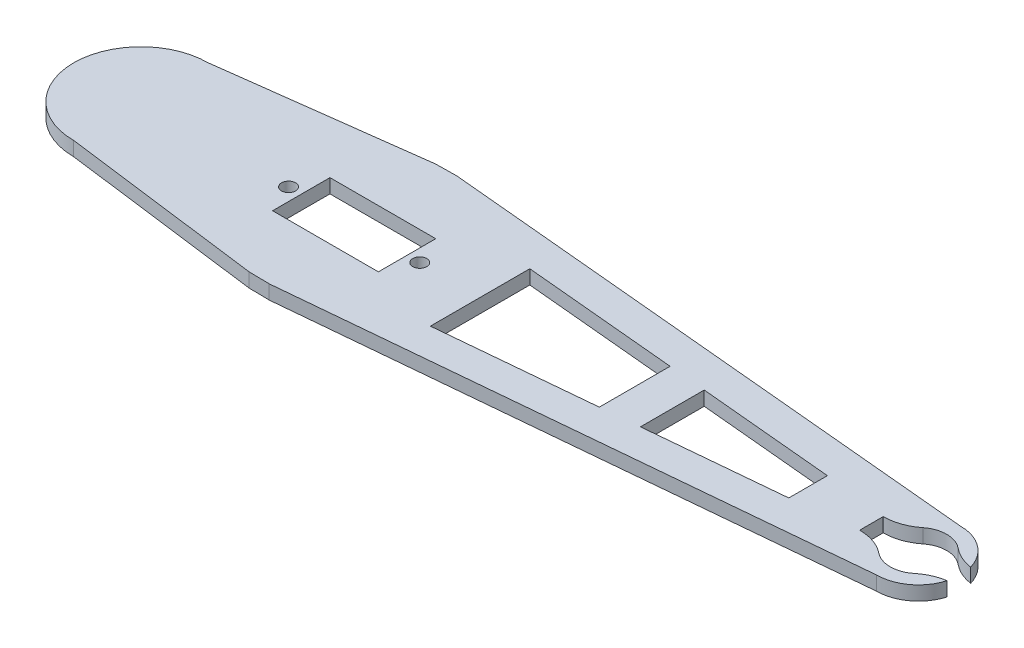
ISO-10303-21;
HEADER;
FILE_DESCRIPTION(('STEP AP214'),'2;1');
FILE_NAME('part.step','',(''),(''),'','','');
FILE_SCHEMA(('AUTOMOTIVE_DESIGN { 1 0 10303 214 1 1 1 1 }'));
ENDSEC;
DATA;
#1=APPLICATION_CONTEXT('core data for automotive mechanical design processes');
#2=APPLICATION_PROTOCOL_DEFINITION('international standard','automotive_design',2000,#1);
#3=PRODUCT_CONTEXT('',#1,'mechanical');
#4=PRODUCT('Part','Part','',(#3));
#5=PRODUCT_RELATED_PRODUCT_CATEGORY('part','',(#4));
#6=PRODUCT_DEFINITION_FORMATION('','',#4);
#7=PRODUCT_DEFINITION_CONTEXT('part definition',#1,'design');
#8=PRODUCT_DEFINITION('design','',#6,#7);
#9=PRODUCT_DEFINITION_SHAPE('','',#8);
#10=(LENGTH_UNIT() NAMED_UNIT(*) SI_UNIT(.MILLI.,.METRE.));
#11=(NAMED_UNIT(*) PLANE_ANGLE_UNIT() SI_UNIT($,.RADIAN.));
#12=(NAMED_UNIT(*) SI_UNIT($,.STERADIAN.) SOLID_ANGLE_UNIT());
#13=UNCERTAINTY_MEASURE_WITH_UNIT(LENGTH_MEASURE(1.E-05),#10,'distance_accuracy_value','');
#14=(GEOMETRIC_REPRESENTATION_CONTEXT(3) GLOBAL_UNCERTAINTY_ASSIGNED_CONTEXT((#13)) GLOBAL_UNIT_ASSIGNED_CONTEXT((#10,
#11,#12)) REPRESENTATION_CONTEXT('',''));
#15=CARTESIAN_POINT('',(0.,0.,0.));
#16=DIRECTION('',(0.,0.,1.));
#17=DIRECTION('',(1.,0.,0.));
#18=AXIS2_PLACEMENT_3D('',#15,#16,#17);
#19=CARTESIAN_POINT('',(120.,3.,0.));
#20=DIRECTION('',(0.,-1.,0.));
#21=DIRECTION('',(0.,0.,-1.));
#22=AXIS2_PLACEMENT_3D('',#19,#20,#21);
#23=CYLINDRICAL_SURFACE('',#22,8.95776317127611);
#24=CARTESIAN_POINT('',(120.,3.,0.));
#25=DIRECTION('',(0.,1.,0.));
#26=DIRECTION('',(0.,0.,-1.));
#27=AXIS2_PLACEMENT_3D('',#24,#25,#26);
#28=CIRCLE('',#27,8.95776317127611);
#29=CARTESIAN_POINT('',(128.601832422959,3.,-2.5));
#30=VERTEX_POINT('',#29);
#31=CARTESIAN_POINT('',(120.,3.,-8.95776317127611));
#32=VERTEX_POINT('',#31);
#33=EDGE_CURVE('E403',#30,#32,#28,.T.);
#34=ORIENTED_EDGE('',*,*,#33,.F.);
#35=DIRECTION('',(0.,-1.,0.));
#36=VECTOR('',#35,1.);
#37=CARTESIAN_POINT('',(128.601832422959,3.,-2.5));
#38=LINE('',#37,#36);
#39=CARTESIAN_POINT('',(128.601832422959,0.,-2.5));
#40=VERTEX_POINT('',#39);
#41=EDGE_CURVE('E272',#30,#40,#38,.T.);
#42=ORIENTED_EDGE('',*,*,#41,.T.);
#43=CARTESIAN_POINT('',(120.,0.,0.));
#44=DIRECTION('',(0.,1.,0.));
#45=DIRECTION('',(0.,0.,-1.));
#46=AXIS2_PLACEMENT_3D('',#43,#44,#45);
#47=CIRCLE('',#46,8.95776317127611);
#48=CARTESIAN_POINT('',(120.,0.,-8.95776317127611));
#49=VERTEX_POINT('',#48);
#50=EDGE_CURVE('E422',#40,#49,#47,.T.);
#51=ORIENTED_EDGE('',*,*,#50,.T.);
#52=DIRECTION('',(0.,-1.,0.));
#53=VECTOR('',#52,1.);
#54=CARTESIAN_POINT('',(120.,3.,-8.95776317127611));
#55=LINE('',#54,#53);
#56=EDGE_CURVE('E429',#32,#49,#55,.T.);
#57=ORIENTED_EDGE('',*,*,#56,.F.);
#58=EDGE_LOOP('',(#34,#42,#51,#57));
#59=FACE_BOUND('',#58,.T.);
#60=ADVANCED_FACE('F37',(#59),#23,.T.);
#61=CARTESIAN_POINT('',(120.,3.,0.));
#62=DIRECTION('',(0.,-1.,0.));
#63=DIRECTION('',(0.,0.,-1.));
#64=AXIS2_PLACEMENT_3D('',#61,#62,#63);
#65=CYLINDRICAL_SURFACE('',#64,6.00000000000002);
#66=CARTESIAN_POINT('',(120.,0.,0.));
#67=DIRECTION('',(0.,1.,0.));
#68=DIRECTION('',(0.,0.,1.));
#69=AXIS2_PLACEMENT_3D('',#66,#67,#68);
#70=CIRCLE('',#69,6.00000000000002);
#71=CARTESIAN_POINT('',(123.800020625864,0.,-4.64325782646303));
#72=VERTEX_POINT('',#71);
#73=CARTESIAN_POINT('',(116.254690433355,0.,-4.68750000000001));
#74=VERTEX_POINT('',#73);
#75=EDGE_CURVE('E280',#72,#74,#70,.T.);
#76=ORIENTED_EDGE('',*,*,#75,.F.);
#77=DIRECTION('',(0.,-1.,0.));
#78=VECTOR('',#77,1.);
#79=CARTESIAN_POINT('',(123.800020625864,3.,-4.64325782646303));
#80=LINE('',#79,#78);
#81=CARTESIAN_POINT('',(123.800020625864,3.,-4.64325782646302));
#82=VERTEX_POINT('',#81);
#83=EDGE_CURVE('E460',#72,#82,#80,.F.);
#84=ORIENTED_EDGE('',*,*,#83,.T.);
#85=CARTESIAN_POINT('',(120.,3.,0.));
#86=DIRECTION('',(0.,1.,0.));
#87=DIRECTION('',(0.,0.,1.));
#88=AXIS2_PLACEMENT_3D('',#85,#86,#87);
#89=CIRCLE('',#88,6.00000000000002);
#90=CARTESIAN_POINT('',(116.254690433355,3.,-4.68750000000001));
#91=VERTEX_POINT('',#90);
#92=EDGE_CURVE('E279',#82,#91,#89,.T.);
#93=ORIENTED_EDGE('',*,*,#92,.T.);
#94=DIRECTION('',(0.,-1.,0.));
#95=VECTOR('',#94,1.);
#96=CARTESIAN_POINT('',(116.254690433355,3.,-4.68750000000001));
#97=LINE('',#96,#95);
#98=EDGE_CURVE('E458',#91,#74,#97,.T.);
#99=ORIENTED_EDGE('',*,*,#98,.T.);
#100=EDGE_LOOP('',(#76,#84,#93,#99));
#101=FACE_BOUND('',#100,.T.);
#102=ADVANCED_FACE('F532',(#101),#65,.F.);
#103=CARTESIAN_POINT('',(120.,3.,0.));
#104=DIRECTION('',(0.,-1.,0.));
#105=DIRECTION('',(0.,0.,-1.));
#106=AXIS2_PLACEMENT_3D('',#103,#104,#105);
#107=PLANE('',#106);
#108=CARTESIAN_POINT('',(-13.95,3.,0.));
#109=DIRECTION('',(0.,1.,0.));
#110=DIRECTION('',(0.,0.,1.));
#111=AXIS2_PLACEMENT_3D('',#108,#109,#110);
#112=CIRCLE('',#111,1.5);
#113=CARTESIAN_POINT('',(-13.95,3.,1.5));
#114=VERTEX_POINT('',#113);
#115=EDGE_CURVE('E315',#114,#114,#112,.T.);
#116=ORIENTED_EDGE('',*,*,#115,.F.);
#117=EDGE_LOOP('',(#116));
#118=FACE_BOUND('',#117,.T.);
#119=CARTESIAN_POINT('',(13.95,3.,0.));
#120=DIRECTION('',(0.,1.,0.));
#121=DIRECTION('',(0.,0.,1.));
#122=AXIS2_PLACEMENT_3D('',#119,#120,#121);
#123=CIRCLE('',#122,1.5);
#124=CARTESIAN_POINT('',(13.95,3.,1.5));
#125=VERTEX_POINT('',#124);
#126=EDGE_CURVE('E321',#125,#125,#123,.T.);
#127=ORIENTED_EDGE('',*,*,#126,.F.);
#128=EDGE_LOOP('',(#127));
#129=FACE_BOUND('',#128,.T.);
#130=DIRECTION('',(0.,0.,-1.));
#131=VECTOR('',#130,1.);
#132=CARTESIAN_POINT('',(96.5291672845656,3.,-4.10426717337135));
#133=LINE('',#132,#131);
#134=CARTESIAN_POINT('',(96.5291672845656,3.,4.10426717337135));
#135=VERTEX_POINT('',#134);
#136=CARTESIAN_POINT('',(96.5291672845656,3.,-4.10426717337135));
#137=VERTEX_POINT('',#136);
#138=EDGE_CURVE('E327',#135,#137,#133,.T.);
#139=ORIENTED_EDGE('',*,*,#138,.F.);
#140=DIRECTION('',(0.9957277620175,0.,-0.0923375543731872));
#141=VECTOR('',#140,1.);
#142=CARTESIAN_POINT('',(96.5291672845656,3.,4.10426717337135));
#143=LINE('',#142,#141);
#144=CARTESIAN_POINT('',(67.6603473994946,3.,6.78138066514184));
#145=VERTEX_POINT('',#144);
#146=EDGE_CURVE('E335',#145,#135,#143,.T.);
#147=ORIENTED_EDGE('',*,*,#146,.F.);
#148=DIRECTION('',(0.,0.,1.));
#149=VECTOR('',#148,1.);
#150=CARTESIAN_POINT('',(67.6603473994946,3.,-6.78138066514184));
#151=LINE('',#150,#149);
#152=CARTESIAN_POINT('',(67.6603473994946,3.,-6.78138066514184));
#153=VERTEX_POINT('',#152);
#154=EDGE_CURVE('E332',#153,#145,#151,.T.);
#155=ORIENTED_EDGE('',*,*,#154,.F.);
#156=DIRECTION('',(-0.9957277620175,0.,-0.092337554373187));
#157=VECTOR('',#156,1.);
#158=CARTESIAN_POINT('',(96.5291672845656,3.,-4.10426717337135));
#159=LINE('',#158,#157);
#160=EDGE_CURVE('E329',#137,#153,#159,.T.);
#161=ORIENTED_EDGE('',*,*,#160,.F.);
#162=EDGE_LOOP('',(#139,#147,#155,#161));
#163=FACE_BOUND('',#162,.T.);
#164=ORIENTED_EDGE('',*,*,#92,.F.);
#165=CARTESIAN_POINT('',(130.133388335637,3.,-12.382020870568));
#166=DIRECTION('',(0.,-1.,0.));
#167=DIRECTION('',(0.,0.,-1.));
#168=AXIS2_PLACEMENT_3D('',#165,#166,#167);
#169=CIRCLE('',#168,10.);
#170=EDGE_CURVE('E466',#82,#30,#169,.F.);
#171=ORIENTED_EDGE('',*,*,#170,.T.);
#172=ORIENTED_EDGE('',*,*,#33,.T.);
#173=DIRECTION('',(-0.9957277620175,0.,-0.0923375543731871));
#174=VECTOR('',#173,1.);
#175=CARTESIAN_POINT('',(1.84675108746374,3.,-19.91455524035));
#176=LINE('',#175,#174);
#177=CARTESIAN_POINT('',(1.84675108746374,3.,-19.91455524035));
#178=VERTEX_POINT('',#177);
#179=EDGE_CURVE('E407',#32,#178,#176,.T.);
#180=ORIENTED_EDGE('',*,*,#179,.T.);
#181=DIRECTION('',(-0.999836383133335,0.,0.018088862950765));
#182=VECTOR('',#181,1.);
#183=CARTESIAN_POINT('',(-2.56588798882,3.,-19.834722554874));
#184=LINE('',#183,#182);
#185=CARTESIAN_POINT('',(-2.56588798882,3.,-19.834722554874));
#186=VERTEX_POINT('',#185);
#187=EDGE_CURVE('E389',#178,#186,#184,.T.);
#188=ORIENTED_EDGE('',*,*,#187,.T.);
#189=DIRECTION('',(-0.991736127743702,0.,0.128294399441));
#190=VECTOR('',#189,1.);
#191=CARTESIAN_POINT('',(-45.3434905183184,3.,-14.3008646338827));
#192=LINE('',#191,#190);
#193=CARTESIAN_POINT('',(-45.3434905183184,3.,-14.3008646338827));
#194=VERTEX_POINT('',#193);
#195=EDGE_CURVE('E392',#186,#194,#192,.T.);
#196=ORIENTED_EDGE('',*,*,#195,.T.);
#197=CARTESIAN_POINT('',(-45.3434905183184,3.,0.));
#198=DIRECTION('',(0.,1.,0.));
#199=DIRECTION('',(0.,0.,1.));
#200=AXIS2_PLACEMENT_3D('',#197,#198,#199);
#201=CIRCLE('',#200,14.3008646338827);
#202=CARTESIAN_POINT('',(-45.3434905183184,3.,14.3008646338827));
#203=VERTEX_POINT('',#202);
#204=EDGE_CURVE('E395',#194,#203,#201,.T.);
#205=ORIENTED_EDGE('',*,*,#204,.T.);
#206=DIRECTION('',(0.991736127743702,0.,0.128294399441));
#207=VECTOR('',#206,1.);
#208=CARTESIAN_POINT('',(-45.3434905183184,3.,14.3008646338827));
#209=LINE('',#208,#207);
#210=CARTESIAN_POINT('',(-2.56588798882,3.,19.834722554874));
#211=VERTEX_POINT('',#210);
#212=EDGE_CURVE('E397',#203,#211,#209,.T.);
#213=ORIENTED_EDGE('',*,*,#212,.T.);
#214=DIRECTION('',(0.999836383133335,0.,0.0180888629507665));
#215=VECTOR('',#214,1.);
#216=CARTESIAN_POINT('',(-2.56588798882,3.,19.834722554874));
#217=LINE('',#216,#215);
#218=CARTESIAN_POINT('',(1.84675108746374,3.,19.91455524035));
#219=VERTEX_POINT('',#218);
#220=EDGE_CURVE('E399',#211,#219,#217,.T.);
#221=ORIENTED_EDGE('',*,*,#220,.T.);
#222=DIRECTION('',(0.9957277620175,0.,-0.0923375543731872));
#223=VECTOR('',#222,1.);
#224=CARTESIAN_POINT('',(120.,3.,8.95776317127611));
#225=LINE('',#224,#223);
#226=CARTESIAN_POINT('',(120.,3.,8.95776317127611));
#227=VERTEX_POINT('',#226);
#228=EDGE_CURVE('E401',#219,#227,#225,.T.);
#229=ORIENTED_EDGE('',*,*,#228,.T.);
#230=CARTESIAN_POINT('',(128.601832422959,3.,2.5));
#231=VERTEX_POINT('',#230);
#232=EDGE_CURVE('E404',#227,#231,#28,.T.);
#233=ORIENTED_EDGE('',*,*,#232,.T.);
#234=CARTESIAN_POINT('',(130.133388335637,3.,12.382020870568));
#235=DIRECTION('',(0.,-1.,0.));
#236=DIRECTION('',(0.,0.,-1.));
#237=AXIS2_PLACEMENT_3D('',#234,#235,#236);
#238=CIRCLE('',#237,10.);
#239=CARTESIAN_POINT('',(123.800020625864,3.,4.64325782646303));
#240=VERTEX_POINT('',#239);
#241=EDGE_CURVE('E464',#231,#240,#238,.F.);
#242=ORIENTED_EDGE('',*,*,#241,.T.);
#243=CARTESIAN_POINT('',(116.254690433355,3.,4.68750000000001));
#244=VERTEX_POINT('',#243);
#245=EDGE_CURVE('E276',#244,#240,#89,.T.);
#246=ORIENTED_EDGE('',*,*,#245,.F.);
#247=CARTESIAN_POINT('',(110.012507822281,3.,12.5));
#248=DIRECTION('',(0.,-1.,0.));
#249=DIRECTION('',(0.,0.,-1.));
#250=AXIS2_PLACEMENT_3D('',#247,#248,#249);
#251=CIRCLE('',#250,10.);
#252=CARTESIAN_POINT('',(110.012507822281,3.,2.5));
#253=VERTEX_POINT('',#252);
#254=EDGE_CURVE('E59',#244,#253,#251,.F.);
#255=ORIENTED_EDGE('',*,*,#254,.T.);
#256=DIRECTION('',(1.,0.,0.));
#257=VECTOR('',#256,1.);
#258=CARTESIAN_POINT('',(130.,3.,2.5));
#259=LINE('',#258,#257);
#260=CARTESIAN_POINT('',(110.,3.,2.5));
#261=VERTEX_POINT('',#260);
#262=EDGE_CURVE('E262',#261,#253,#259,.T.);
#263=ORIENTED_EDGE('',*,*,#262,.F.);
#264=DIRECTION('',(0.,0.,1.));
#265=VECTOR('',#264,1.);
#266=CARTESIAN_POINT('',(110.,3.,-2.5));
#267=LINE('',#266,#265);
#268=CARTESIAN_POINT('',(110.,3.,-2.5));
#269=VERTEX_POINT('',#268);
#270=EDGE_CURVE('E243',#269,#261,#267,.T.);
#271=ORIENTED_EDGE('',*,*,#270,.F.);
#272=DIRECTION('',(-1.,0.,0.));
#273=VECTOR('',#272,1.);
#274=CARTESIAN_POINT('',(130.,3.,-2.5));
#275=LINE('',#274,#273);
#276=CARTESIAN_POINT('',(110.012507822281,3.,-2.5));
#277=VERTEX_POINT('',#276);
#278=EDGE_CURVE('E260',#277,#269,#275,.T.);
#279=ORIENTED_EDGE('',*,*,#278,.F.);
#280=CARTESIAN_POINT('',(110.012507822281,3.,-12.5));
#281=DIRECTION('',(0.,-1.,0.));
#282=DIRECTION('',(0.,0.,-1.));
#283=AXIS2_PLACEMENT_3D('',#280,#281,#282);
#284=CIRCLE('',#283,10.);
#285=EDGE_CURVE('E52',#277,#91,#284,.F.);
#286=ORIENTED_EDGE('',*,*,#285,.T.);
#287=EDGE_LOOP('',(#164,#171,#172,#180,#188,#196,#205,#213,#221,#229,#233,#242,#246,#255,#263,
#271,#279,#286));
#288=FACE_BOUND('',#287,.T.);
#289=DIRECTION('',(0.,0.,-1.));
#290=VECTOR('',#289,1.);
#291=CARTESIAN_POINT('',(11.25,3.,-6.1));
#292=LINE('',#291,#290);
#293=CARTESIAN_POINT('',(11.25,3.,6.1));
#294=VERTEX_POINT('',#293);
#295=CARTESIAN_POINT('',(11.25,3.,-6.1));
#296=VERTEX_POINT('',#295);
#297=EDGE_CURVE('E358',#294,#296,#292,.T.);
#298=ORIENTED_EDGE('',*,*,#297,.F.);
#299=DIRECTION('',(1.,0.,0.));
#300=VECTOR('',#299,1.);
#301=CARTESIAN_POINT('',(-11.25,3.,6.1));
#302=LINE('',#301,#300);
#303=CARTESIAN_POINT('',(-11.25,3.,6.1));
#304=VERTEX_POINT('',#303);
#305=EDGE_CURVE('E366',#304,#294,#302,.T.);
#306=ORIENTED_EDGE('',*,*,#305,.F.);
#307=DIRECTION('',(0.,0.,1.));
#308=VECTOR('',#307,1.);
#309=CARTESIAN_POINT('',(-11.25,3.,-6.1));
#310=LINE('',#309,#308);
#311=CARTESIAN_POINT('',(-11.25,3.,-6.1));
#312=VERTEX_POINT('',#311);
#313=EDGE_CURVE('E363',#312,#304,#310,.T.);
#314=ORIENTED_EDGE('',*,*,#313,.F.);
#315=DIRECTION('',(-1.,0.,0.));
#316=VECTOR('',#315,1.);
#317=CARTESIAN_POINT('',(-11.25,3.,-6.1));
#318=LINE('',#317,#316);
#319=EDGE_CURVE('E360',#296,#312,#318,.T.);
#320=ORIENTED_EDGE('',*,*,#319,.F.);
#321=EDGE_LOOP('',(#298,#306,#314,#320));
#322=FACE_BOUND('',#321,.T.);
#323=DIRECTION('',(0.,0.,-1.));
#324=VECTOR('',#323,1.);
#325=CARTESIAN_POINT('',(59.6591330402502,3.,7.52336315687362));
#326=LINE('',#325,#324);
#327=CARTESIAN_POINT('',(59.6591330402502,3.,7.52336315687362));
#328=VERTEX_POINT('',#327);
#329=CARTESIAN_POINT('',(59.6591330402502,3.,-7.52336315687363));
#330=VERTEX_POINT('',#329);
#331=EDGE_CURVE('E283',#328,#330,#326,.T.);
#332=ORIENTED_EDGE('',*,*,#331,.F.);
#333=DIRECTION('',(0.9957277620175,0.,-0.0923375543731874));
#334=VECTOR('',#333,1.);
#335=CARTESIAN_POINT('',(26.7796007232022,3.,10.5724049923036));
#336=LINE('',#335,#334);
#337=CARTESIAN_POINT('',(26.7796007232022,3.,10.5724049923036));
#338=VERTEX_POINT('',#337);
#339=EDGE_CURVE('E291',#338,#328,#336,.T.);
#340=ORIENTED_EDGE('',*,*,#339,.F.);
#341=DIRECTION('',(0.,0.,1.));
#342=VECTOR('',#341,1.);
#343=CARTESIAN_POINT('',(26.7796007232022,3.,-10.5724049923036));
#344=LINE('',#343,#342);
#345=CARTESIAN_POINT('',(26.7796007232022,3.,-10.5724049923036));
#346=VERTEX_POINT('',#345);
#347=EDGE_CURVE('E288',#346,#338,#344,.T.);
#348=ORIENTED_EDGE('',*,*,#347,.F.);
#349=DIRECTION('',(-0.9957277620175,0.,-0.092337554373187));
#350=VECTOR('',#349,1.);
#351=CARTESIAN_POINT('',(59.6591330402502,3.,-7.52336315687363));
#352=LINE('',#351,#350);
#353=EDGE_CURVE('E285',#330,#346,#352,.T.);
#354=ORIENTED_EDGE('',*,*,#353,.F.);
#355=EDGE_LOOP('',(#332,#340,#348,#354));
#356=FACE_BOUND('',#355,.T.);
#357=ADVANCED_FACE('F485',(#118,#129,#163,#288,#322,#356),#107,.F.);
#358=CARTESIAN_POINT('',(120.,0.,0.));
#359=DIRECTION('',(0.,-1.,0.));
#360=DIRECTION('',(0.,0.,-1.));
#361=AXIS2_PLACEMENT_3D('',#358,#359,#360);
#362=PLANE('',#361);
#363=ORIENTED_EDGE('',*,*,#50,.F.);
#364=CARTESIAN_POINT('',(130.133388335637,0.,-12.382020870568));
#365=DIRECTION('',(0.,-1.,0.));
#366=DIRECTION('',(0.,0.,-1.));
#367=AXIS2_PLACEMENT_3D('',#364,#365,#366);
#368=CIRCLE('',#367,10.);
#369=EDGE_CURVE('E456',#40,#72,#368,.T.);
#370=ORIENTED_EDGE('',*,*,#369,.T.);
#371=ORIENTED_EDGE('',*,*,#75,.T.);
#372=CARTESIAN_POINT('',(110.012507822281,0.,-12.5));
#373=DIRECTION('',(0.,-1.,0.));
#374=DIRECTION('',(0.,0.,-1.));
#375=AXIS2_PLACEMENT_3D('',#372,#373,#374);
#376=CIRCLE('',#375,10.);
#377=CARTESIAN_POINT('',(110.012507822281,0.,-2.5));
#378=VERTEX_POINT('',#377);
#379=EDGE_CURVE('E450',#74,#378,#376,.T.);
#380=ORIENTED_EDGE('',*,*,#379,.T.);
#381=DIRECTION('',(-1.,0.,0.));
#382=VECTOR('',#381,1.);
#383=CARTESIAN_POINT('',(130.,0.,-2.5));
#384=LINE('',#383,#382);
#385=CARTESIAN_POINT('',(110.,0.,-2.5));
#386=VERTEX_POINT('',#385);
#387=EDGE_CURVE('E246',#378,#386,#384,.T.);
#388=ORIENTED_EDGE('',*,*,#387,.T.);
#389=DIRECTION('',(0.,0.,1.));
#390=VECTOR('',#389,1.);
#391=CARTESIAN_POINT('',(110.,0.,-2.5));
#392=LINE('',#391,#390);
#393=CARTESIAN_POINT('',(110.,0.,2.5));
#394=VERTEX_POINT('',#393);
#395=EDGE_CURVE('E241',#386,#394,#392,.T.);
#396=ORIENTED_EDGE('',*,*,#395,.T.);
#397=DIRECTION('',(1.,0.,0.));
#398=VECTOR('',#397,1.);
#399=CARTESIAN_POINT('',(130.,0.,2.5));
#400=LINE('',#399,#398);
#401=CARTESIAN_POINT('',(110.012507822281,0.,2.5));
#402=VERTEX_POINT('',#401);
#403=EDGE_CURVE('E250',#394,#402,#400,.T.);
#404=ORIENTED_EDGE('',*,*,#403,.T.);
#405=CARTESIAN_POINT('',(110.012507822281,0.,12.5));
#406=DIRECTION('',(0.,-1.,0.));
#407=DIRECTION('',(0.,0.,-1.));
#408=AXIS2_PLACEMENT_3D('',#405,#406,#407);
#409=CIRCLE('',#408,10.);
#410=CARTESIAN_POINT('',(116.254690433355,0.,4.68750000000001));
#411=VERTEX_POINT('',#410);
#412=EDGE_CURVE('E452',#402,#411,#409,.T.);
#413=ORIENTED_EDGE('',*,*,#412,.T.);
#414=CARTESIAN_POINT('',(123.800020625864,0.,4.64325782646302));
#415=VERTEX_POINT('',#414);
#416=EDGE_CURVE('E275',#411,#415,#70,.T.);
#417=ORIENTED_EDGE('',*,*,#416,.T.);
#418=CARTESIAN_POINT('',(130.133388335637,0.,12.382020870568));
#419=DIRECTION('',(0.,-1.,0.));
#420=DIRECTION('',(0.,0.,-1.));
#421=AXIS2_PLACEMENT_3D('',#418,#419,#420);
#422=CIRCLE('',#421,10.);
#423=CARTESIAN_POINT('',(128.601832422959,0.,2.5));
#424=VERTEX_POINT('',#423);
#425=EDGE_CURVE('E454',#415,#424,#422,.T.);
#426=ORIENTED_EDGE('',*,*,#425,.T.);
#427=CARTESIAN_POINT('',(120.,0.,8.95776317127611));
#428=VERTEX_POINT('',#427);
#429=EDGE_CURVE('E423',#428,#424,#47,.T.);
#430=ORIENTED_EDGE('',*,*,#429,.F.);
#431=DIRECTION('',(0.9957277620175,0.,-0.0923375543731872));
#432=VECTOR('',#431,1.);
#433=CARTESIAN_POINT('',(120.,0.,8.95776317127611));
#434=LINE('',#433,#432);
#435=CARTESIAN_POINT('',(1.84675108746374,0.,19.91455524035));
#436=VERTEX_POINT('',#435);
#437=EDGE_CURVE('E420',#436,#428,#434,.T.);
#438=ORIENTED_EDGE('',*,*,#437,.F.);
#439=DIRECTION('',(0.999836383133335,0.,0.0180888629507665));
#440=VECTOR('',#439,1.);
#441=CARTESIAN_POINT('',(-2.56588798882,0.,19.834722554874));
#442=LINE('',#441,#440);
#443=CARTESIAN_POINT('',(-2.56588798882,0.,19.834722554874));
#444=VERTEX_POINT('',#443);
#445=EDGE_CURVE('E418',#444,#436,#442,.T.);
#446=ORIENTED_EDGE('',*,*,#445,.F.);
#447=DIRECTION('',(0.991736127743702,0.,0.128294399441));
#448=VECTOR('',#447,1.);
#449=CARTESIAN_POINT('',(-45.3434905183184,0.,14.3008646338827));
#450=LINE('',#449,#448);
#451=CARTESIAN_POINT('',(-45.3434905183184,0.,14.3008646338827));
#452=VERTEX_POINT('',#451);
#453=EDGE_CURVE('E416',#452,#444,#450,.T.);
#454=ORIENTED_EDGE('',*,*,#453,.F.);
#455=CARTESIAN_POINT('',(-45.3434905183184,0.,0.));
#456=DIRECTION('',(0.,1.,0.));
#457=DIRECTION('',(0.,0.,1.));
#458=AXIS2_PLACEMENT_3D('',#455,#456,#457);
#459=CIRCLE('',#458,14.3008646338827);
#460=CARTESIAN_POINT('',(-45.3434905183184,0.,-14.3008646338827));
#461=VERTEX_POINT('',#460);
#462=EDGE_CURVE('E414',#461,#452,#459,.T.);
#463=ORIENTED_EDGE('',*,*,#462,.F.);
#464=DIRECTION('',(-0.991736127743702,0.,0.128294399441));
#465=VECTOR('',#464,1.);
#466=CARTESIAN_POINT('',(-45.3434905183184,0.,-14.3008646338827));
#467=LINE('',#466,#465);
#468=CARTESIAN_POINT('',(-2.56588798882,0.,-19.834722554874));
#469=VERTEX_POINT('',#468);
#470=EDGE_CURVE('E412',#469,#461,#467,.T.);
#471=ORIENTED_EDGE('',*,*,#470,.F.);
#472=DIRECTION('',(-0.999836383133335,0.,0.018088862950765));
#473=VECTOR('',#472,1.);
#474=CARTESIAN_POINT('',(-2.56588798882,0.,-19.834722554874));
#475=LINE('',#474,#473);
#476=CARTESIAN_POINT('',(1.84675108746374,0.,-19.91455524035));
#477=VERTEX_POINT('',#476);
#478=EDGE_CURVE('E388',#477,#469,#475,.T.);
#479=ORIENTED_EDGE('',*,*,#478,.F.);
#480=DIRECTION('',(-0.9957277620175,0.,-0.0923375543731871));
#481=VECTOR('',#480,1.);
#482=CARTESIAN_POINT('',(1.84675108746374,0.,-19.91455524035));
#483=LINE('',#482,#481);
#484=EDGE_CURVE('E393',#49,#477,#483,.T.);
#485=ORIENTED_EDGE('',*,*,#484,.F.);
#486=EDGE_LOOP('',(#363,#370,#371,#380,#388,#396,#404,#413,#417,#426,#430,#438,#446,#454,#463,
#471,#479,#485));
#487=FACE_BOUND('',#486,.T.);
#488=DIRECTION('',(0.9957277620175,0.,-0.0923375543731874));
#489=VECTOR('',#488,1.);
#490=CARTESIAN_POINT('',(26.7796007232022,0.,10.5724049923036));
#491=LINE('',#490,#489);
#492=CARTESIAN_POINT('',(26.7796007232022,0.,10.5724049923036));
#493=VERTEX_POINT('',#492);
#494=CARTESIAN_POINT('',(59.6591330402502,0.,7.52336315687362));
#495=VERTEX_POINT('',#494);
#496=EDGE_CURVE('E286',#493,#495,#491,.T.);
#497=ORIENTED_EDGE('',*,*,#496,.T.);
#498=DIRECTION('',(0.,0.,-1.));
#499=VECTOR('',#498,1.);
#500=CARTESIAN_POINT('',(59.6591330402502,0.,7.52336315687362));
#501=LINE('',#500,#499);
#502=CARTESIAN_POINT('',(59.6591330402502,0.,-7.52336315687363));
#503=VERTEX_POINT('',#502);
#504=EDGE_CURVE('E294',#495,#503,#501,.T.);
#505=ORIENTED_EDGE('',*,*,#504,.T.);
#506=DIRECTION('',(-0.9957277620175,0.,-0.092337554373187));
#507=VECTOR('',#506,1.);
#508=CARTESIAN_POINT('',(59.6591330402502,0.,-7.52336315687363));
#509=LINE('',#508,#507);
#510=CARTESIAN_POINT('',(26.7796007232022,0.,-10.5724049923036));
#511=VERTEX_POINT('',#510);
#512=EDGE_CURVE('E297',#503,#511,#509,.T.);
#513=ORIENTED_EDGE('',*,*,#512,.T.);
#514=DIRECTION('',(0.,0.,1.));
#515=VECTOR('',#514,1.);
#516=CARTESIAN_POINT('',(26.7796007232022,0.,-10.5724049923036));
#517=LINE('',#516,#515);
#518=EDGE_CURVE('E300',#511,#493,#517,.T.);
#519=ORIENTED_EDGE('',*,*,#518,.T.);
#520=EDGE_LOOP('',(#497,#505,#513,#519));
#521=FACE_BOUND('',#520,.T.);
#522=CARTESIAN_POINT('',(-13.95,0.,0.));
#523=DIRECTION('',(0.,1.,0.));
#524=DIRECTION('',(0.,0.,1.));
#525=AXIS2_PLACEMENT_3D('',#522,#523,#524);
#526=CIRCLE('',#525,1.5);
#527=CARTESIAN_POINT('',(-13.95,0.,1.5));
#528=VERTEX_POINT('',#527);
#529=EDGE_CURVE('E314',#528,#528,#526,.T.);
#530=ORIENTED_EDGE('',*,*,#529,.T.);
#531=EDGE_LOOP('',(#530));
#532=FACE_BOUND('',#531,.T.);
#533=DIRECTION('',(0.9957277620175,0.,-0.0923375543731872));
#534=VECTOR('',#533,1.);
#535=CARTESIAN_POINT('',(96.5291672845656,0.,4.10426717337135));
#536=LINE('',#535,#534);
#537=CARTESIAN_POINT('',(67.6603473994946,0.,6.78138066514184));
#538=VERTEX_POINT('',#537);
#539=CARTESIAN_POINT('',(96.5291672845656,0.,4.10426717337134));
#540=VERTEX_POINT('',#539);
#541=EDGE_CURVE('E330',#538,#540,#536,.T.);
#542=ORIENTED_EDGE('',*,*,#541,.T.);
#543=DIRECTION('',(0.,0.,-1.));
#544=VECTOR('',#543,1.);
#545=CARTESIAN_POINT('',(96.5291672845656,0.,-4.10426717337135));
#546=LINE('',#545,#544);
#547=CARTESIAN_POINT('',(96.5291672845656,0.,-4.10426717337135));
#548=VERTEX_POINT('',#547);
#549=EDGE_CURVE('E324',#540,#548,#546,.T.);
#550=ORIENTED_EDGE('',*,*,#549,.T.);
#551=DIRECTION('',(-0.9957277620175,0.,-0.092337554373187));
#552=VECTOR('',#551,1.);
#553=CARTESIAN_POINT('',(96.5291672845656,0.,-4.10426717337135));
#554=LINE('',#553,#552);
#555=CARTESIAN_POINT('',(67.6603473994946,0.,-6.78138066514184));
#556=VERTEX_POINT('',#555);
#557=EDGE_CURVE('E340',#548,#556,#554,.T.);
#558=ORIENTED_EDGE('',*,*,#557,.T.);
#559=DIRECTION('',(0.,0.,1.));
#560=VECTOR('',#559,1.);
#561=CARTESIAN_POINT('',(67.6603473994946,0.,-6.78138066514184));
#562=LINE('',#561,#560);
#563=EDGE_CURVE('E343',#556,#538,#562,.T.);
#564=ORIENTED_EDGE('',*,*,#563,.T.);
#565=EDGE_LOOP('',(#542,#550,#558,#564));
#566=FACE_BOUND('',#565,.T.);
#567=DIRECTION('',(1.,0.,0.));
#568=VECTOR('',#567,1.);
#569=CARTESIAN_POINT('',(-11.25,0.,6.1));
#570=LINE('',#569,#568);
#571=CARTESIAN_POINT('',(-11.25,0.,6.1));
#572=VERTEX_POINT('',#571);
#573=CARTESIAN_POINT('',(11.25,0.,6.1));
#574=VERTEX_POINT('',#573);
#575=EDGE_CURVE('E361',#572,#574,#570,.T.);
#576=ORIENTED_EDGE('',*,*,#575,.T.);
#577=DIRECTION('',(0.,0.,-1.));
#578=VECTOR('',#577,1.);
#579=CARTESIAN_POINT('',(11.25,0.,-6.1));
#580=LINE('',#579,#578);
#581=CARTESIAN_POINT('',(11.25,0.,-6.1));
#582=VERTEX_POINT('',#581);
#583=EDGE_CURVE('E357',#574,#582,#580,.T.);
#584=ORIENTED_EDGE('',*,*,#583,.T.);
#585=DIRECTION('',(-1.,0.,0.));
#586=VECTOR('',#585,1.);
#587=CARTESIAN_POINT('',(-11.25,0.,-6.1));
#588=LINE('',#587,#586);
#589=CARTESIAN_POINT('',(-11.25,0.,-6.1));
#590=VERTEX_POINT('',#589);
#591=EDGE_CURVE('E371',#582,#590,#588,.T.);
#592=ORIENTED_EDGE('',*,*,#591,.T.);
#593=DIRECTION('',(0.,0.,1.));
#594=VECTOR('',#593,1.);
#595=CARTESIAN_POINT('',(-11.25,0.,-6.1));
#596=LINE('',#595,#594);
#597=EDGE_CURVE('E374',#590,#572,#596,.T.);
#598=ORIENTED_EDGE('',*,*,#597,.T.);
#599=EDGE_LOOP('',(#576,#584,#592,#598));
#600=FACE_BOUND('',#599,.T.);
#601=CARTESIAN_POINT('',(13.95,0.,0.));
#602=DIRECTION('',(0.,1.,0.));
#603=DIRECTION('',(0.,0.,1.));
#604=AXIS2_PLACEMENT_3D('',#601,#602,#603);
#605=CIRCLE('',#604,1.5);
#606=CARTESIAN_POINT('',(13.95,0.,1.5));
#607=VERTEX_POINT('',#606);
#608=EDGE_CURVE('E318',#607,#607,#605,.T.);
#609=ORIENTED_EDGE('',*,*,#608,.T.);
#610=EDGE_LOOP('',(#609));
#611=FACE_BOUND('',#610,.T.);
#612=ADVANCED_FACE('F256',(#487,#521,#532,#566,#600,#611),#362,.T.);
#613=CARTESIAN_POINT('',(-2.56588798882,3.,-19.834722554874));
#614=DIRECTION('',(0.018088862950765,0.,0.999836383133335));
#615=DIRECTION('',(0.999836383133335,0.,-0.018088862950765));
#616=AXIS2_PLACEMENT_3D('',#613,#614,#615);
#617=PLANE('',#616);
#618=ORIENTED_EDGE('',*,*,#478,.T.);
#619=DIRECTION('',(0.,-1.,0.));
#620=VECTOR('',#619,1.);
#621=CARTESIAN_POINT('',(-2.56588798882,3.,-19.834722554874));
#622=LINE('',#621,#620);
#623=EDGE_CURVE('E447',#186,#469,#622,.T.);
#624=ORIENTED_EDGE('',*,*,#623,.F.);
#625=ORIENTED_EDGE('',*,*,#187,.F.);
#626=DIRECTION('',(0.,-1.,0.));
#627=VECTOR('',#626,1.);
#628=CARTESIAN_POINT('',(1.84675108746374,3.,-19.91455524035));
#629=LINE('',#628,#627);
#630=EDGE_CURVE('E409',#178,#477,#629,.T.);
#631=ORIENTED_EDGE('',*,*,#630,.T.);
#632=EDGE_LOOP('',(#618,#624,#625,#631));
#633=FACE_BOUND('',#632,.T.);
#634=ADVANCED_FACE('F515',(#633),#617,.F.);
#635=CARTESIAN_POINT('',(-45.3434905183184,3.,-14.3008646338827));
#636=DIRECTION('',(0.128294399441,0.,0.991736127743702));
#637=DIRECTION('',(0.991736127743702,0.,-0.128294399441));
#638=AXIS2_PLACEMENT_3D('',#635,#636,#637);
#639=PLANE('',#638);
#640=ORIENTED_EDGE('',*,*,#470,.T.);
#641=DIRECTION('',(0.,-1.,0.));
#642=VECTOR('',#641,1.);
#643=CARTESIAN_POINT('',(-45.3434905183184,3.,-14.3008646338827));
#644=LINE('',#643,#642);
#645=EDGE_CURVE('E444',#194,#461,#644,.T.);
#646=ORIENTED_EDGE('',*,*,#645,.F.);
#647=ORIENTED_EDGE('',*,*,#195,.F.);
#648=ORIENTED_EDGE('',*,*,#623,.T.);
#649=EDGE_LOOP('',(#640,#646,#647,#648));
#650=FACE_BOUND('',#649,.T.);
#651=ADVANCED_FACE('F512',(#650),#639,.F.);
#652=CARTESIAN_POINT('',(-45.3434905183184,3.,0.));
#653=DIRECTION('',(0.,-1.,0.));
#654=DIRECTION('',(0.,0.,-1.));
#655=AXIS2_PLACEMENT_3D('',#652,#653,#654);
#656=CYLINDRICAL_SURFACE('',#655,14.3008646338827);
#657=ORIENTED_EDGE('',*,*,#462,.T.);
#658=DIRECTION('',(0.,-1.,0.));
#659=VECTOR('',#658,1.);
#660=CARTESIAN_POINT('',(-45.3434905183184,3.,14.3008646338827));
#661=LINE('',#660,#659);
#662=EDGE_CURVE('E441',#203,#452,#661,.T.);
#663=ORIENTED_EDGE('',*,*,#662,.F.);
#664=ORIENTED_EDGE('',*,*,#204,.F.);
#665=ORIENTED_EDGE('',*,*,#645,.T.);
#666=EDGE_LOOP('',(#657,#663,#664,#665));
#667=FACE_BOUND('',#666,.T.);
#668=ADVANCED_FACE('F506',(#667),#656,.T.);
#669=CARTESIAN_POINT('',(-45.3434905183184,3.,14.3008646338827));
#670=DIRECTION('',(0.128294399441,0.,-0.991736127743702));
#671=DIRECTION('',(-0.991736127743702,0.,-0.128294399441));
#672=AXIS2_PLACEMENT_3D('',#669,#670,#671);
#673=PLANE('',#672);
#674=ORIENTED_EDGE('',*,*,#453,.T.);
#675=DIRECTION('',(0.,-1.,0.));
#676=VECTOR('',#675,1.);
#677=CARTESIAN_POINT('',(-2.56588798882,3.,19.834722554874));
#678=LINE('',#677,#676);
#679=EDGE_CURVE('E438',#211,#444,#678,.T.);
#680=ORIENTED_EDGE('',*,*,#679,.F.);
#681=ORIENTED_EDGE('',*,*,#212,.F.);
#682=ORIENTED_EDGE('',*,*,#662,.T.);
#683=EDGE_LOOP('',(#674,#680,#681,#682));
#684=FACE_BOUND('',#683,.T.);
#685=ADVANCED_FACE('F502',(#684),#673,.F.);
#686=CARTESIAN_POINT('',(-2.56588798882,3.,19.834722554874));
#687=DIRECTION('',(0.0180888629507665,0.,-0.999836383133335));
#688=DIRECTION('',(-0.999836383133335,0.,-0.0180888629507665));
#689=AXIS2_PLACEMENT_3D('',#686,#687,#688);
#690=PLANE('',#689);
#691=ORIENTED_EDGE('',*,*,#445,.T.);
#692=DIRECTION('',(0.,-1.,0.));
#693=VECTOR('',#692,1.);
#694=CARTESIAN_POINT('',(1.84675108746374,3.,19.91455524035));
#695=LINE('',#694,#693);
#696=EDGE_CURVE('E435',#219,#436,#695,.T.);
#697=ORIENTED_EDGE('',*,*,#696,.F.);
#698=ORIENTED_EDGE('',*,*,#220,.F.);
#699=ORIENTED_EDGE('',*,*,#679,.T.);
#700=EDGE_LOOP('',(#691,#697,#698,#699));
#701=FACE_BOUND('',#700,.T.);
#702=ADVANCED_FACE('F498',(#701),#690,.F.);
#703=CARTESIAN_POINT('',(120.,3.,8.95776317127611));
#704=DIRECTION('',(-0.0923375543731872,0.,-0.9957277620175));
#705=DIRECTION('',(-0.9957277620175,0.,0.0923375543731872));
#706=AXIS2_PLACEMENT_3D('',#703,#704,#705);
#707=PLANE('',#706);
#708=ORIENTED_EDGE('',*,*,#437,.T.);
#709=DIRECTION('',(0.,-1.,0.));
#710=VECTOR('',#709,1.);
#711=CARTESIAN_POINT('',(120.,3.,8.95776317127611));
#712=LINE('',#711,#710);
#713=EDGE_CURVE('E432',#227,#428,#712,.T.);
#714=ORIENTED_EDGE('',*,*,#713,.F.);
#715=ORIENTED_EDGE('',*,*,#228,.F.);
#716=ORIENTED_EDGE('',*,*,#696,.T.);
#717=EDGE_LOOP('',(#708,#714,#715,#716));
#718=FACE_BOUND('',#717,.T.);
#719=ADVANCED_FACE('F492',(#718),#707,.F.);
#720=ORIENTED_EDGE('',*,*,#429,.T.);
#721=DIRECTION('',(0.,-1.,0.));
#722=VECTOR('',#721,1.);
#723=CARTESIAN_POINT('',(128.601832422959,3.,2.5));
#724=LINE('',#723,#722);
#725=EDGE_CURVE('E268',#424,#231,#724,.F.);
#726=ORIENTED_EDGE('',*,*,#725,.T.);
#727=ORIENTED_EDGE('',*,*,#232,.F.);
#728=ORIENTED_EDGE('',*,*,#713,.T.);
#729=EDGE_LOOP('',(#720,#726,#727,#728));
#730=FACE_BOUND('',#729,.T.);
#731=ADVANCED_FACE('F483',(#730),#23,.T.);
#732=CARTESIAN_POINT('',(1.84675108746374,3.,-19.91455524035));
#733=DIRECTION('',(-0.0923375543731871,0.,0.9957277620175));
#734=DIRECTION('',(0.9957277620175,0.,0.0923375543731871));
#735=AXIS2_PLACEMENT_3D('',#732,#733,#734);
#736=PLANE('',#735);
#737=ORIENTED_EDGE('',*,*,#484,.T.);
#738=ORIENTED_EDGE('',*,*,#630,.F.);
#739=ORIENTED_EDGE('',*,*,#179,.F.);
#740=ORIENTED_EDGE('',*,*,#56,.T.);
#741=EDGE_LOOP('',(#737,#738,#739,#740));
#742=FACE_BOUND('',#741,.T.);
#743=ADVANCED_FACE('F519',(#742),#736,.F.);
#744=CARTESIAN_POINT('',(11.25,3.,-6.1));
#745=DIRECTION('',(-1.,0.,0.));
#746=DIRECTION('',(0.,0.,1.));
#747=AXIS2_PLACEMENT_3D('',#744,#745,#746);
#748=PLANE('',#747);
#749=ORIENTED_EDGE('',*,*,#583,.F.);
#750=DIRECTION('',(0.,-1.,0.));
#751=VECTOR('',#750,1.);
#752=CARTESIAN_POINT('',(11.25,3.,6.1));
#753=LINE('',#752,#751);
#754=EDGE_CURVE('E368',#294,#574,#753,.T.);
#755=ORIENTED_EDGE('',*,*,#754,.F.);
#756=ORIENTED_EDGE('',*,*,#297,.T.);
#757=DIRECTION('',(0.,-1.,0.));
#758=VECTOR('',#757,1.);
#759=CARTESIAN_POINT('',(11.25,3.,-6.1));
#760=LINE('',#759,#758);
#761=EDGE_CURVE('E385',#296,#582,#760,.T.);
#762=ORIENTED_EDGE('',*,*,#761,.T.);
#763=EDGE_LOOP('',(#749,#755,#756,#762));
#764=FACE_BOUND('',#763,.T.);
#765=ADVANCED_FACE('F558',(#764),#748,.T.);
#766=CARTESIAN_POINT('',(-11.25,3.,-6.1));
#767=DIRECTION('',(0.,0.,1.));
#768=DIRECTION('',(1.,0.,0.));
#769=AXIS2_PLACEMENT_3D('',#766,#767,#768);
#770=PLANE('',#769);
#771=ORIENTED_EDGE('',*,*,#591,.F.);
#772=ORIENTED_EDGE('',*,*,#761,.F.);
#773=ORIENTED_EDGE('',*,*,#319,.T.);
#774=DIRECTION('',(0.,-1.,0.));
#775=VECTOR('',#774,1.);
#776=CARTESIAN_POINT('',(-11.25,3.,-6.1));
#777=LINE('',#776,#775);
#778=EDGE_CURVE('E383',#312,#590,#777,.T.);
#779=ORIENTED_EDGE('',*,*,#778,.T.);
#780=EDGE_LOOP('',(#771,#772,#773,#779));
#781=FACE_BOUND('',#780,.T.);
#782=ADVANCED_FACE('F740',(#781),#770,.T.);
#783=CARTESIAN_POINT('',(-11.25,3.,-6.1));
#784=DIRECTION('',(1.,0.,0.));
#785=DIRECTION('',(0.,0.,-1.));
#786=AXIS2_PLACEMENT_3D('',#783,#784,#785);
#787=PLANE('',#786);
#788=ORIENTED_EDGE('',*,*,#597,.F.);
#789=ORIENTED_EDGE('',*,*,#778,.F.);
#790=ORIENTED_EDGE('',*,*,#313,.T.);
#791=DIRECTION('',(0.,-1.,0.));
#792=VECTOR('',#791,1.);
#793=CARTESIAN_POINT('',(-11.25,3.,6.1));
#794=LINE('',#793,#792);
#795=EDGE_CURVE('E381',#304,#572,#794,.T.);
#796=ORIENTED_EDGE('',*,*,#795,.T.);
#797=EDGE_LOOP('',(#788,#789,#790,#796));
#798=FACE_BOUND('',#797,.T.);
#799=ADVANCED_FACE('F731',(#798),#787,.T.);
#800=CARTESIAN_POINT('',(-11.25,3.,6.1));
#801=DIRECTION('',(0.,0.,-1.));
#802=DIRECTION('',(-1.,0.,0.));
#803=AXIS2_PLACEMENT_3D('',#800,#801,#802);
#804=PLANE('',#803);
#805=ORIENTED_EDGE('',*,*,#575,.F.);
#806=ORIENTED_EDGE('',*,*,#795,.F.);
#807=ORIENTED_EDGE('',*,*,#305,.T.);
#808=ORIENTED_EDGE('',*,*,#754,.T.);
#809=EDGE_LOOP('',(#805,#806,#807,#808));
#810=FACE_BOUND('',#809,.T.);
#811=ADVANCED_FACE('F722',(#810),#804,.T.);
#812=CARTESIAN_POINT('',(96.5291672845656,3.,-4.10426717337135));
#813=DIRECTION('',(-1.,0.,0.));
#814=DIRECTION('',(0.,0.,1.));
#815=AXIS2_PLACEMENT_3D('',#812,#813,#814);
#816=PLANE('',#815);
#817=ORIENTED_EDGE('',*,*,#549,.F.);
#818=DIRECTION('',(0.,-1.,0.));
#819=VECTOR('',#818,1.);
#820=CARTESIAN_POINT('',(96.5291672845656,3.,4.10426717337135));
#821=LINE('',#820,#819);
#822=EDGE_CURVE('E337',#135,#540,#821,.T.);
#823=ORIENTED_EDGE('',*,*,#822,.F.);
#824=ORIENTED_EDGE('',*,*,#138,.T.);
#825=DIRECTION('',(0.,-1.,0.));
#826=VECTOR('',#825,1.);
#827=CARTESIAN_POINT('',(96.5291672845656,3.,-4.10426717337135));
#828=LINE('',#827,#826);
#829=EDGE_CURVE('E354',#137,#548,#828,.T.);
#830=ORIENTED_EDGE('',*,*,#829,.T.);
#831=EDGE_LOOP('',(#817,#823,#824,#830));
#832=FACE_BOUND('',#831,.T.);
#833=ADVANCED_FACE('F713',(#832),#816,.T.);
#834=CARTESIAN_POINT('',(96.5291672845656,3.,-4.10426717337135));
#835=DIRECTION('',(-0.092337554373187,0.,0.9957277620175));
#836=DIRECTION('',(0.9957277620175,0.,0.092337554373187));
#837=AXIS2_PLACEMENT_3D('',#834,#835,#836);
#838=PLANE('',#837);
#839=ORIENTED_EDGE('',*,*,#557,.F.);
#840=ORIENTED_EDGE('',*,*,#829,.F.);
#841=ORIENTED_EDGE('',*,*,#160,.T.);
#842=DIRECTION('',(0.,-1.,0.));
#843=VECTOR('',#842,1.);
#844=CARTESIAN_POINT('',(67.6603473994946,3.,-6.78138066514184));
#845=LINE('',#844,#843);
#846=EDGE_CURVE('E352',#153,#556,#845,.T.);
#847=ORIENTED_EDGE('',*,*,#846,.T.);
#848=EDGE_LOOP('',(#839,#840,#841,#847));
#849=FACE_BOUND('',#848,.T.);
#850=ADVANCED_FACE('F704',(#849),#838,.T.);
#851=CARTESIAN_POINT('',(67.6603473994946,3.,-6.78138066514184));
#852=DIRECTION('',(1.,0.,0.));
#853=DIRECTION('',(0.,0.,-1.));
#854=AXIS2_PLACEMENT_3D('',#851,#852,#853);
#855=PLANE('',#854);
#856=ORIENTED_EDGE('',*,*,#563,.F.);
#857=ORIENTED_EDGE('',*,*,#846,.F.);
#858=ORIENTED_EDGE('',*,*,#154,.T.);
#859=DIRECTION('',(0.,-1.,0.));
#860=VECTOR('',#859,1.);
#861=CARTESIAN_POINT('',(67.6603473994946,3.,6.78138066514184));
#862=LINE('',#861,#860);
#863=EDGE_CURVE('E350',#145,#538,#862,.T.);
#864=ORIENTED_EDGE('',*,*,#863,.T.);
#865=EDGE_LOOP('',(#856,#857,#858,#864));
#866=FACE_BOUND('',#865,.T.);
#867=ADVANCED_FACE('F695',(#866),#855,.T.);
#868=CARTESIAN_POINT('',(96.5291672845656,3.,4.10426717337135));
#869=DIRECTION('',(-0.0923375543731872,0.,-0.9957277620175));
#870=DIRECTION('',(-0.9957277620175,0.,0.0923375543731872));
#871=AXIS2_PLACEMENT_3D('',#868,#869,#870);
#872=PLANE('',#871);
#873=ORIENTED_EDGE('',*,*,#541,.F.);
#874=ORIENTED_EDGE('',*,*,#863,.F.);
#875=ORIENTED_EDGE('',*,*,#146,.T.);
#876=ORIENTED_EDGE('',*,*,#822,.T.);
#877=EDGE_LOOP('',(#873,#874,#875,#876));
#878=FACE_BOUND('',#877,.T.);
#879=ADVANCED_FACE('F686',(#878),#872,.T.);
#880=CARTESIAN_POINT('',(13.95,3.,0.));
#881=DIRECTION('',(0.,-1.,0.));
#882=DIRECTION('',(0.,0.,-1.));
#883=AXIS2_PLACEMENT_3D('',#880,#881,#882);
#884=CYLINDRICAL_SURFACE('',#883,1.5);
#885=ORIENTED_EDGE('',*,*,#126,.T.);
#886=EDGE_LOOP('',(#885));
#887=FACE_BOUND('',#886,.T.);
#888=ORIENTED_EDGE('',*,*,#608,.F.);
#889=EDGE_LOOP('',(#888));
#890=FACE_BOUND('',#889,.T.);
#891=ADVANCED_FACE('F677',(#887,#890),#884,.F.);
#892=CARTESIAN_POINT('',(-13.95,3.,0.));
#893=DIRECTION('',(0.,-1.,0.));
#894=DIRECTION('',(0.,0.,-1.));
#895=AXIS2_PLACEMENT_3D('',#892,#893,#894);
#896=CYLINDRICAL_SURFACE('',#895,1.5);
#897=ORIENTED_EDGE('',*,*,#115,.T.);
#898=EDGE_LOOP('',(#897));
#899=FACE_BOUND('',#898,.T.);
#900=ORIENTED_EDGE('',*,*,#529,.F.);
#901=EDGE_LOOP('',(#900));
#902=FACE_BOUND('',#901,.T.);
#903=ADVANCED_FACE('F668',(#899,#902),#896,.F.);
#904=CARTESIAN_POINT('',(59.6591330402502,3.,7.52336315687362));
#905=DIRECTION('',(-1.,0.,0.));
#906=DIRECTION('',(0.,0.,1.));
#907=AXIS2_PLACEMENT_3D('',#904,#905,#906);
#908=PLANE('',#907);
#909=ORIENTED_EDGE('',*,*,#504,.F.);
#910=DIRECTION('',(0.,-1.,0.));
#911=VECTOR('',#910,1.);
#912=CARTESIAN_POINT('',(59.6591330402502,3.,7.52336315687362));
#913=LINE('',#912,#911);
#914=EDGE_CURVE('E293',#328,#495,#913,.T.);
#915=ORIENTED_EDGE('',*,*,#914,.F.);
#916=ORIENTED_EDGE('',*,*,#331,.T.);
#917=DIRECTION('',(0.,-1.,0.));
#918=VECTOR('',#917,1.);
#919=CARTESIAN_POINT('',(59.6591330402502,3.,-7.52336315687363));
#920=LINE('',#919,#918);
#921=EDGE_CURVE('E311',#330,#503,#920,.T.);
#922=ORIENTED_EDGE('',*,*,#921,.T.);
#923=EDGE_LOOP('',(#909,#915,#916,#922));
#924=FACE_BOUND('',#923,.T.);
#925=ADVANCED_FACE('F659',(#924),#908,.T.);
#926=CARTESIAN_POINT('',(59.6591330402502,3.,-7.52336315687363));
#927=DIRECTION('',(-0.092337554373187,0.,0.9957277620175));
#928=DIRECTION('',(0.9957277620175,0.,0.092337554373187));
#929=AXIS2_PLACEMENT_3D('',#926,#927,#928);
#930=PLANE('',#929);
#931=ORIENTED_EDGE('',*,*,#512,.F.);
#932=ORIENTED_EDGE('',*,*,#921,.F.);
#933=ORIENTED_EDGE('',*,*,#353,.T.);
#934=DIRECTION('',(0.,-1.,0.));
#935=VECTOR('',#934,1.);
#936=CARTESIAN_POINT('',(26.7796007232022,3.,-10.5724049923036));
#937=LINE('',#936,#935);
#938=EDGE_CURVE('E309',#346,#511,#937,.T.);
#939=ORIENTED_EDGE('',*,*,#938,.T.);
#940=EDGE_LOOP('',(#931,#932,#933,#939));
#941=FACE_BOUND('',#940,.T.);
#942=ADVANCED_FACE('F650',(#941),#930,.T.);
#943=CARTESIAN_POINT('',(26.7796007232022,3.,-10.5724049923036));
#944=DIRECTION('',(1.,0.,0.));
#945=DIRECTION('',(0.,0.,-1.));
#946=AXIS2_PLACEMENT_3D('',#943,#944,#945);
#947=PLANE('',#946);
#948=ORIENTED_EDGE('',*,*,#518,.F.);
#949=ORIENTED_EDGE('',*,*,#938,.F.);
#950=ORIENTED_EDGE('',*,*,#347,.T.);
#951=DIRECTION('',(0.,-1.,0.));
#952=VECTOR('',#951,1.);
#953=CARTESIAN_POINT('',(26.7796007232022,3.,10.5724049923036));
#954=LINE('',#953,#952);
#955=EDGE_CURVE('E307',#338,#493,#954,.T.);
#956=ORIENTED_EDGE('',*,*,#955,.T.);
#957=EDGE_LOOP('',(#948,#949,#950,#956));
#958=FACE_BOUND('',#957,.T.);
#959=ADVANCED_FACE('F641',(#958),#947,.T.);
#960=CARTESIAN_POINT('',(26.7796007232022,3.,10.5724049923036));
#961=DIRECTION('',(-0.0923375543731874,0.,-0.9957277620175));
#962=DIRECTION('',(-0.9957277620175,0.,0.0923375543731874));
#963=AXIS2_PLACEMENT_3D('',#960,#961,#962);
#964=PLANE('',#963);
#965=ORIENTED_EDGE('',*,*,#496,.F.);
#966=ORIENTED_EDGE('',*,*,#955,.F.);
#967=ORIENTED_EDGE('',*,*,#339,.T.);
#968=ORIENTED_EDGE('',*,*,#914,.T.);
#969=EDGE_LOOP('',(#965,#966,#967,#968));
#970=FACE_BOUND('',#969,.T.);
#971=ADVANCED_FACE('F635',(#970),#964,.T.);
#972=ORIENTED_EDGE('',*,*,#245,.T.);
#973=DIRECTION('',(0.,-1.,0.));
#974=VECTOR('',#973,1.);
#975=CARTESIAN_POINT('',(123.800020625864,3.,4.64325782646303));
#976=LINE('',#975,#974);
#977=EDGE_CURVE('E470',#240,#415,#976,.T.);
#978=ORIENTED_EDGE('',*,*,#977,.T.);
#979=ORIENTED_EDGE('',*,*,#416,.F.);
#980=DIRECTION('',(0.,-1.,0.));
#981=VECTOR('',#980,1.);
#982=CARTESIAN_POINT('',(116.254690433355,3.,4.68750000000001));
#983=LINE('',#982,#981);
#984=EDGE_CURVE('E468',#411,#244,#983,.F.);
#985=ORIENTED_EDGE('',*,*,#984,.T.);
#986=EDGE_LOOP('',(#972,#978,#979,#985));
#987=FACE_BOUND('',#986,.T.);
#988=ADVANCED_FACE('F474',(#987),#65,.F.);
#989=CARTESIAN_POINT('',(130.,0.,2.5));
#990=DIRECTION('',(0.,0.,1.));
#991=DIRECTION('',(1.,0.,0.));
#992=AXIS2_PLACEMENT_3D('',#989,#990,#991);
#993=PLANE('',#992);
#994=ORIENTED_EDGE('',*,*,#262,.T.);
#995=DIRECTION('',(0.,1.,0.));
#996=VECTOR('',#995,1.);
#997=CARTESIAN_POINT('',(110.012507822281,0.,2.5));
#998=LINE('',#997,#996);
#999=EDGE_CURVE('E45',#253,#402,#998,.F.);
#1000=ORIENTED_EDGE('',*,*,#999,.T.);
#1001=ORIENTED_EDGE('',*,*,#403,.F.);
#1002=DIRECTION('',(0.,1.,0.));
#1003=VECTOR('',#1002,1.);
#1004=CARTESIAN_POINT('',(110.,0.,2.5));
#1005=LINE('',#1004,#1003);
#1006=EDGE_CURVE('E236',#394,#261,#1005,.T.);
#1007=ORIENTED_EDGE('',*,*,#1006,.T.);
#1008=EDGE_LOOP('',(#994,#1000,#1001,#1007));
#1009=FACE_BOUND('',#1008,.T.);
#1010=ADVANCED_FACE('F251',(#1009),#993,.F.);
#1011=CARTESIAN_POINT('',(130.,0.,-2.5));
#1012=DIRECTION('',(0.,0.,-1.));
#1013=DIRECTION('',(-1.,0.,0.));
#1014=AXIS2_PLACEMENT_3D('',#1011,#1012,#1013);
#1015=PLANE('',#1014);
#1016=ORIENTED_EDGE('',*,*,#387,.F.);
#1017=DIRECTION('',(0.,1.,0.));
#1018=VECTOR('',#1017,1.);
#1019=CARTESIAN_POINT('',(110.012507822281,3.,-2.5));
#1020=LINE('',#1019,#1018);
#1021=EDGE_CURVE('E11',#378,#277,#1020,.T.);
#1022=ORIENTED_EDGE('',*,*,#1021,.T.);
#1023=ORIENTED_EDGE('',*,*,#278,.T.);
#1024=DIRECTION('',(0.,1.,0.));
#1025=VECTOR('',#1024,1.);
#1026=CARTESIAN_POINT('',(110.,0.,-2.5));
#1027=LINE('',#1026,#1025);
#1028=EDGE_CURVE('E245',#386,#269,#1027,.T.);
#1029=ORIENTED_EDGE('',*,*,#1028,.F.);
#1030=EDGE_LOOP('',(#1016,#1022,#1023,#1029));
#1031=FACE_BOUND('',#1030,.T.);
#1032=ADVANCED_FACE('F535',(#1031),#1015,.F.);
#1033=CARTESIAN_POINT('',(110.,0.,-2.5));
#1034=DIRECTION('',(-1.,0.,0.));
#1035=DIRECTION('',(0.,0.,1.));
#1036=AXIS2_PLACEMENT_3D('',#1033,#1034,#1035);
#1037=PLANE('',#1036);
#1038=ORIENTED_EDGE('',*,*,#270,.T.);
#1039=ORIENTED_EDGE('',*,*,#1006,.F.);
#1040=ORIENTED_EDGE('',*,*,#395,.F.);
#1041=ORIENTED_EDGE('',*,*,#1028,.T.);
#1042=EDGE_LOOP('',(#1038,#1039,#1040,#1041));
#1043=FACE_BOUND('',#1042,.T.);
#1044=ADVANCED_FACE('F238',(#1043),#1037,.F.);
#1045=CARTESIAN_POINT('',(130.133388335637,3.,-12.382020870568));
#1046=DIRECTION('',(0.,-1.,0.));
#1047=DIRECTION('',(0.,0.,-1.));
#1048=AXIS2_PLACEMENT_3D('',#1045,#1046,#1047);
#1049=CYLINDRICAL_SURFACE('',#1048,10.);
#1050=ORIENTED_EDGE('',*,*,#170,.F.);
#1051=ORIENTED_EDGE('',*,*,#83,.F.);
#1052=ORIENTED_EDGE('',*,*,#369,.F.);
#1053=ORIENTED_EDGE('',*,*,#41,.F.);
#1054=EDGE_LOOP('',(#1050,#1051,#1052,#1053));
#1055=FACE_BOUND('',#1054,.T.);
#1056=ADVANCED_FACE('F528',(#1055),#1049,.T.);
#1057=CARTESIAN_POINT('',(130.133388335637,3.,12.382020870568));
#1058=DIRECTION('',(0.,1.,0.));
#1059=DIRECTION('',(0.,0.,1.));
#1060=AXIS2_PLACEMENT_3D('',#1057,#1058,#1059);
#1061=CYLINDRICAL_SURFACE('',#1060,10.);
#1062=ORIENTED_EDGE('',*,*,#425,.F.);
#1063=ORIENTED_EDGE('',*,*,#977,.F.);
#1064=ORIENTED_EDGE('',*,*,#241,.F.);
#1065=ORIENTED_EDGE('',*,*,#725,.F.);
#1066=EDGE_LOOP('',(#1062,#1063,#1064,#1065));
#1067=FACE_BOUND('',#1066,.T.);
#1068=ADVANCED_FACE('F480',(#1067),#1061,.T.);
#1069=CARTESIAN_POINT('',(110.012507822281,3.,12.5));
#1070=DIRECTION('',(0.,-1.,0.));
#1071=DIRECTION('',(0.,0.,-1.));
#1072=AXIS2_PLACEMENT_3D('',#1069,#1070,#1071);
#1073=CYLINDRICAL_SURFACE('',#1072,10.);
#1074=ORIENTED_EDGE('',*,*,#254,.F.);
#1075=ORIENTED_EDGE('',*,*,#984,.F.);
#1076=ORIENTED_EDGE('',*,*,#412,.F.);
#1077=ORIENTED_EDGE('',*,*,#999,.F.);
#1078=EDGE_LOOP('',(#1074,#1075,#1076,#1077));
#1079=FACE_BOUND('',#1078,.T.);
#1080=ADVANCED_FACE('F538',(#1079),#1073,.T.);
#1081=CARTESIAN_POINT('',(110.012507822281,3.,-12.5));
#1082=DIRECTION('',(0.,-1.,0.));
#1083=DIRECTION('',(0.,0.,-1.));
#1084=AXIS2_PLACEMENT_3D('',#1081,#1082,#1083);
#1085=CYLINDRICAL_SURFACE('',#1084,10.);
#1086=ORIENTED_EDGE('',*,*,#379,.F.);
#1087=ORIENTED_EDGE('',*,*,#98,.F.);
#1088=ORIENTED_EDGE('',*,*,#285,.F.);
#1089=ORIENTED_EDGE('',*,*,#1021,.F.);
#1090=EDGE_LOOP('',(#1086,#1087,#1088,#1089));
#1091=FACE_BOUND('',#1090,.T.);
#1092=ADVANCED_FACE('F39',(#1091),#1085,.T.);
#1093=CLOSED_SHELL('',(#60,#102,#357,#612,#634,#651,#668,#685,#702,#719,#731,#743,#765,#782,
#799,#811,#833,#850,#867,#879,#891,#903,#925,#942,#959,#971,#988,#1010,#1032,#1044,#1056,#1068,
#1080,#1092));
#1094=MANIFOLD_SOLID_BREP('B2',#1093);
#1095=ADVANCED_BREP_SHAPE_REPRESENTATION('',(#18,#1094),#14);
#1096=SHAPE_DEFINITION_REPRESENTATION(#9,#1095);
ENDSEC;
END-ISO-10303-21;
